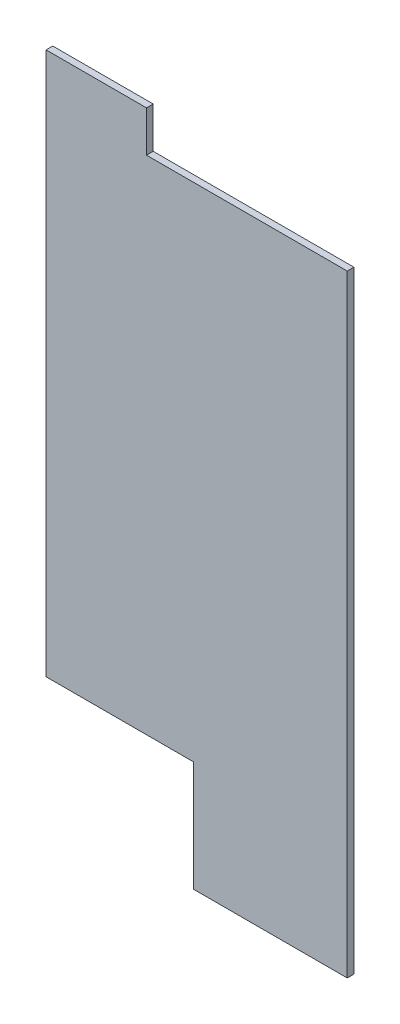
ISO-10303-21;
HEADER;
FILE_DESCRIPTION(('STEP AP214'),'2;1');
FILE_NAME('part.step','',(''),(''),'','','');
FILE_SCHEMA(('AUTOMOTIVE_DESIGN { 1 0 10303 214 1 1 1 1 }'));
ENDSEC;
DATA;
#1=APPLICATION_CONTEXT('core data for automotive mechanical design processes');
#2=APPLICATION_PROTOCOL_DEFINITION('international standard','automotive_design',2000,#1);
#3=PRODUCT_CONTEXT('',#1,'mechanical');
#4=PRODUCT('Part','Part','',(#3));
#5=PRODUCT_RELATED_PRODUCT_CATEGORY('part','',(#4));
#6=PRODUCT_DEFINITION_FORMATION('','',#4);
#7=PRODUCT_DEFINITION_CONTEXT('part definition',#1,'design');
#8=PRODUCT_DEFINITION('design','',#6,#7);
#9=PRODUCT_DEFINITION_SHAPE('','',#8);
#10=(LENGTH_UNIT() NAMED_UNIT(*) SI_UNIT(.MILLI.,.METRE.));
#11=(NAMED_UNIT(*) PLANE_ANGLE_UNIT() SI_UNIT($,.RADIAN.));
#12=(NAMED_UNIT(*) SI_UNIT($,.STERADIAN.) SOLID_ANGLE_UNIT());
#13=UNCERTAINTY_MEASURE_WITH_UNIT(LENGTH_MEASURE(1.E-05),#10,'distance_accuracy_value','');
#14=(GEOMETRIC_REPRESENTATION_CONTEXT(3) GLOBAL_UNCERTAINTY_ASSIGNED_CONTEXT((#13)) GLOBAL_UNIT_ASSIGNED_CONTEXT((#10,
#11,#12)) REPRESENTATION_CONTEXT('',''));
#15=CARTESIAN_POINT('',(0.,0.,0.));
#16=DIRECTION('',(0.,0.,1.));
#17=DIRECTION('',(1.,0.,0.));
#18=AXIS2_PLACEMENT_3D('',#15,#16,#17);
#19=CARTESIAN_POINT('',(-22.5,-37.5,1.));
#20=DIRECTION('',(1.,0.,0.));
#21=DIRECTION('',(0.,0.,-1.));
#22=AXIS2_PLACEMENT_3D('',#19,#20,#21);
#23=PLANE('',#22);
#24=DIRECTION('',(0.,-1.,0.));
#25=VECTOR('',#24,1.);
#26=CARTESIAN_POINT('',(-22.5,-37.5,0.));
#27=LINE('',#26,#25);
#28=CARTESIAN_POINT('',(-22.5,43.6220085638954,0.));
#29=VERTEX_POINT('',#28);
#30=CARTESIAN_POINT('',(-22.5,-37.5,0.));
#31=VERTEX_POINT('',#30);
#32=EDGE_CURVE('E133',#29,#31,#27,.T.);
#33=ORIENTED_EDGE('',*,*,#32,.T.);
#34=DIRECTION('',(0.,0.,-1.));
#35=VECTOR('',#34,1.);
#36=CARTESIAN_POINT('',(-22.5,-37.5,1.));
#37=LINE('',#36,#35);
#38=CARTESIAN_POINT('',(-22.5,-37.5,1.));
#39=VERTEX_POINT('',#38);
#40=EDGE_CURVE('E11',#39,#31,#37,.T.);
#41=ORIENTED_EDGE('',*,*,#40,.F.);
#42=DIRECTION('',(0.,-1.,0.));
#43=VECTOR('',#42,1.);
#44=CARTESIAN_POINT('',(-22.5,-37.5,1.));
#45=LINE('',#44,#43);
#46=CARTESIAN_POINT('',(-22.5,43.6220085638954,1.));
#47=VERTEX_POINT('',#46);
#48=EDGE_CURVE('E117',#47,#39,#45,.T.);
#49=ORIENTED_EDGE('',*,*,#48,.F.);
#50=DIRECTION('',(0.,0.,1.));
#51=VECTOR('',#50,1.);
#52=CARTESIAN_POINT('',(-22.5,43.6220085638954,0.));
#53=LINE('',#52,#51);
#54=EDGE_CURVE('E156',#29,#47,#53,.T.);
#55=ORIENTED_EDGE('',*,*,#54,.F.);
#56=EDGE_LOOP('',(#33,#41,#49,#55));
#57=FACE_BOUND('',#56,.T.);
#58=ADVANCED_FACE('F33',(#57),#23,.F.);
#59=CARTESIAN_POINT('',(22.5,-37.5,1.));
#60=DIRECTION('',(0.,1.,0.));
#61=DIRECTION('',(-1.,0.,0.));
#62=AXIS2_PLACEMENT_3D('',#59,#60,#61);
#63=PLANE('',#62);
#64=DIRECTION('',(1.,0.,0.));
#65=VECTOR('',#64,1.);
#66=CARTESIAN_POINT('',(22.5,-37.5,0.));
#67=LINE('',#66,#65);
#68=CARTESIAN_POINT('',(-0.500000000000002,-37.5,0.));
#69=VERTEX_POINT('',#68);
#70=EDGE_CURVE('E123',#31,#69,#67,.T.);
#71=ORIENTED_EDGE('',*,*,#70,.T.);
#72=DIRECTION('',(0.,0.,1.));
#73=VECTOR('',#72,1.);
#74=CARTESIAN_POINT('',(-0.500000000000002,-37.5,0.));
#75=LINE('',#74,#73);
#76=CARTESIAN_POINT('',(-0.499999999999997,-37.5,1.));
#77=VERTEX_POINT('',#76);
#78=EDGE_CURVE('E135',#69,#77,#75,.T.);
#79=ORIENTED_EDGE('',*,*,#78,.T.);
#80=DIRECTION('',(1.,0.,0.));
#81=VECTOR('',#80,1.);
#82=CARTESIAN_POINT('',(22.5,-37.5,1.));
#83=LINE('',#82,#81);
#84=EDGE_CURVE('E121',#39,#77,#83,.T.);
#85=ORIENTED_EDGE('',*,*,#84,.F.);
#86=ORIENTED_EDGE('',*,*,#40,.T.);
#87=EDGE_LOOP('',(#71,#79,#85,#86));
#88=FACE_BOUND('',#87,.T.);
#89=ADVANCED_FACE('F138',(#88),#63,.F.);
#90=CARTESIAN_POINT('',(22.5,-37.5,1.));
#91=DIRECTION('',(-1.,0.,0.));
#92=DIRECTION('',(0.,0.,1.));
#93=AXIS2_PLACEMENT_3D('',#90,#91,#92);
#94=PLANE('',#93);
#95=DIRECTION('',(0.,1.,0.));
#96=VECTOR('',#95,1.);
#97=CARTESIAN_POINT('',(22.5,-37.5,0.));
#98=LINE('',#97,#96);
#99=CARTESIAN_POINT('',(22.5,-53.9792860244863,0.));
#100=VERTEX_POINT('',#99);
#101=CARTESIAN_POINT('',(22.5,37.5,0.));
#102=VERTEX_POINT('',#101);
#103=EDGE_CURVE('E118',#100,#102,#98,.T.);
#104=ORIENTED_EDGE('',*,*,#103,.T.);
#105=DIRECTION('',(0.,0.,-1.));
#106=VECTOR('',#105,1.);
#107=CARTESIAN_POINT('',(22.5,37.5,1.));
#108=LINE('',#107,#106);
#109=CARTESIAN_POINT('',(22.5,37.5,1.));
#110=VERTEX_POINT('',#109);
#111=EDGE_CURVE('E40',#110,#102,#108,.T.);
#112=ORIENTED_EDGE('',*,*,#111,.F.);
#113=DIRECTION('',(0.,1.,0.));
#114=VECTOR('',#113,1.);
#115=CARTESIAN_POINT('',(22.5,-37.5,1.));
#116=LINE('',#115,#114);
#117=CARTESIAN_POINT('',(22.5,-53.9792860244863,1.));
#118=VERTEX_POINT('',#117);
#119=EDGE_CURVE('E127',#118,#110,#116,.T.);
#120=ORIENTED_EDGE('',*,*,#119,.F.);
#121=DIRECTION('',(0.,0.,1.));
#122=VECTOR('',#121,1.);
#123=CARTESIAN_POINT('',(22.5,-53.9792860244863,0.));
#124=LINE('',#123,#122);
#125=EDGE_CURVE('E159',#100,#118,#124,.T.);
#126=ORIENTED_EDGE('',*,*,#125,.F.);
#127=EDGE_LOOP('',(#104,#112,#120,#126));
#128=FACE_BOUND('',#127,.T.);
#129=ADVANCED_FACE('F190',(#128),#94,.F.);
#130=CARTESIAN_POINT('',(22.5,37.5,1.));
#131=DIRECTION('',(0.,-1.,0.));
#132=DIRECTION('',(1.,0.,0.));
#133=AXIS2_PLACEMENT_3D('',#130,#131,#132);
#134=PLANE('',#133);
#135=DIRECTION('',(-1.,0.,0.));
#136=VECTOR('',#135,1.);
#137=CARTESIAN_POINT('',(22.5,37.5,0.));
#138=LINE('',#137,#136);
#139=CARTESIAN_POINT('',(-7.4939592120975,37.5,0.));
#140=VERTEX_POINT('',#139);
#141=EDGE_CURVE('E110',#102,#140,#138,.T.);
#142=ORIENTED_EDGE('',*,*,#141,.T.);
#143=DIRECTION('',(0.,0.,1.));
#144=VECTOR('',#143,1.);
#145=CARTESIAN_POINT('',(-7.4939592120975,37.5,0.));
#146=LINE('',#145,#144);
#147=CARTESIAN_POINT('',(-7.49395921209749,37.5,1.));
#148=VERTEX_POINT('',#147);
#149=EDGE_CURVE('E95',#140,#148,#146,.T.);
#150=ORIENTED_EDGE('',*,*,#149,.T.);
#151=DIRECTION('',(-1.,0.,0.));
#152=VECTOR('',#151,1.);
#153=CARTESIAN_POINT('',(22.5,37.5,1.));
#154=LINE('',#153,#152);
#155=EDGE_CURVE('E126',#110,#148,#154,.T.);
#156=ORIENTED_EDGE('',*,*,#155,.F.);
#157=ORIENTED_EDGE('',*,*,#111,.T.);
#158=EDGE_LOOP('',(#142,#150,#156,#157));
#159=FACE_BOUND('',#158,.T.);
#160=ADVANCED_FACE('F115',(#159),#134,.F.);
#161=CARTESIAN_POINT('',(0.,0.,1.));
#162=DIRECTION('',(0.,0.,1.));
#163=DIRECTION('',(1.,0.,0.));
#164=AXIS2_PLACEMENT_3D('',#161,#162,#163);
#165=PLANE('',#164);
#166=ORIENTED_EDGE('',*,*,#48,.T.);
#167=ORIENTED_EDGE('',*,*,#84,.T.);
#168=DIRECTION('',(0.,-1.,0.));
#169=VECTOR('',#168,1.);
#170=CARTESIAN_POINT('',(-0.500000000000002,-37.5,1.));
#171=LINE('',#170,#169);
#172=CARTESIAN_POINT('',(-0.500000000000004,-53.9792860244863,1.));
#173=VERTEX_POINT('',#172);
#174=EDGE_CURVE('E55',#77,#173,#171,.T.);
#175=ORIENTED_EDGE('',*,*,#174,.T.);
#176=DIRECTION('',(1.,0.,0.));
#177=VECTOR('',#176,1.);
#178=CARTESIAN_POINT('',(-0.500000000000004,-53.9792860244863,1.));
#179=LINE('',#178,#177);
#180=EDGE_CURVE('E148',#173,#118,#179,.T.);
#181=ORIENTED_EDGE('',*,*,#180,.T.);
#182=ORIENTED_EDGE('',*,*,#119,.T.);
#183=ORIENTED_EDGE('',*,*,#155,.T.);
#184=DIRECTION('',(0.,1.,0.));
#185=VECTOR('',#184,1.);
#186=CARTESIAN_POINT('',(-7.4939592120975,43.6220085638954,1.));
#187=LINE('',#186,#185);
#188=CARTESIAN_POINT('',(-7.4939592120975,43.6220085638954,1.));
#189=VERTEX_POINT('',#188);
#190=EDGE_CURVE('E47',#148,#189,#187,.T.);
#191=ORIENTED_EDGE('',*,*,#190,.T.);
#192=DIRECTION('',(-1.,0.,0.));
#193=VECTOR('',#192,1.);
#194=CARTESIAN_POINT('',(-22.5,43.6220085638954,1.));
#195=LINE('',#194,#193);
#196=EDGE_CURVE('E112',#189,#47,#195,.T.);
#197=ORIENTED_EDGE('',*,*,#196,.T.);
#198=EDGE_LOOP('',(#166,#167,#175,#181,#182,#183,#191,#197));
#199=FACE_BOUND('',#198,.T.);
#200=ADVANCED_FACE('F162',(#199),#165,.T.);
#201=CARTESIAN_POINT('',(0.,0.,0.));
#202=DIRECTION('',(0.,0.,1.));
#203=DIRECTION('',(1.,0.,0.));
#204=AXIS2_PLACEMENT_3D('',#201,#202,#203);
#205=PLANE('',#204);
#206=ORIENTED_EDGE('',*,*,#32,.F.);
#207=DIRECTION('',(-1.,0.,0.));
#208=VECTOR('',#207,1.);
#209=CARTESIAN_POINT('',(-22.5,43.6220085638954,0.));
#210=LINE('',#209,#208);
#211=CARTESIAN_POINT('',(-7.4939592120975,43.6220085638954,0.));
#212=VERTEX_POINT('',#211);
#213=EDGE_CURVE('E105',#212,#29,#210,.T.);
#214=ORIENTED_EDGE('',*,*,#213,.F.);
#215=DIRECTION('',(0.,1.,0.));
#216=VECTOR('',#215,1.);
#217=CARTESIAN_POINT('',(-7.4939592120975,43.6220085638954,0.));
#218=LINE('',#217,#216);
#219=EDGE_CURVE('E98',#140,#212,#218,.T.);
#220=ORIENTED_EDGE('',*,*,#219,.F.);
#221=ORIENTED_EDGE('',*,*,#141,.F.);
#222=ORIENTED_EDGE('',*,*,#103,.F.);
#223=DIRECTION('',(1.,0.,0.));
#224=VECTOR('',#223,1.);
#225=CARTESIAN_POINT('',(-0.500000000000004,-53.9792860244863,0.));
#226=LINE('',#225,#224);
#227=CARTESIAN_POINT('',(-0.500000000000004,-53.9792860244863,0.));
#228=VERTEX_POINT('',#227);
#229=EDGE_CURVE('E147',#228,#100,#226,.T.);
#230=ORIENTED_EDGE('',*,*,#229,.F.);
#231=DIRECTION('',(0.,-1.,0.));
#232=VECTOR('',#231,1.);
#233=CARTESIAN_POINT('',(-0.500000000000002,-37.5,0.));
#234=LINE('',#233,#232);
#235=EDGE_CURVE('E145',#69,#228,#234,.T.);
#236=ORIENTED_EDGE('',*,*,#235,.F.);
#237=ORIENTED_EDGE('',*,*,#70,.F.);
#238=EDGE_LOOP('',(#206,#214,#220,#221,#222,#230,#236,#237));
#239=FACE_BOUND('',#238,.T.);
#240=ADVANCED_FACE('F109',(#239),#205,.F.);
#241=CARTESIAN_POINT('',(-0.500000000000002,-37.5,0.));
#242=DIRECTION('',(-1.,0.,0.));
#243=DIRECTION('',(0.,-1.,0.));
#244=AXIS2_PLACEMENT_3D('',#241,#242,#243);
#245=PLANE('',#244);
#246=ORIENTED_EDGE('',*,*,#174,.F.);
#247=ORIENTED_EDGE('',*,*,#78,.F.);
#248=ORIENTED_EDGE('',*,*,#235,.T.);
#249=DIRECTION('',(0.,0.,1.));
#250=VECTOR('',#249,1.);
#251=CARTESIAN_POINT('',(-0.500000000000004,-53.9792860244863,0.));
#252=LINE('',#251,#250);
#253=EDGE_CURVE('E150',#228,#173,#252,.T.);
#254=ORIENTED_EDGE('',*,*,#253,.T.);
#255=EDGE_LOOP('',(#246,#247,#248,#254));
#256=FACE_BOUND('',#255,.T.);
#257=ADVANCED_FACE('F182',(#256),#245,.T.);
#258=CARTESIAN_POINT('',(-0.500000000000004,-53.9792860244863,0.));
#259=DIRECTION('',(0.,-1.,0.));
#260=DIRECTION('',(0.,0.,-1.));
#261=AXIS2_PLACEMENT_3D('',#258,#259,#260);
#262=PLANE('',#261);
#263=ORIENTED_EDGE('',*,*,#180,.F.);
#264=ORIENTED_EDGE('',*,*,#253,.F.);
#265=ORIENTED_EDGE('',*,*,#229,.T.);
#266=ORIENTED_EDGE('',*,*,#125,.T.);
#267=EDGE_LOOP('',(#263,#264,#265,#266));
#268=FACE_BOUND('',#267,.T.);
#269=ADVANCED_FACE('F174',(#268),#262,.T.);
#270=CARTESIAN_POINT('',(-22.5,43.6220085638954,0.));
#271=DIRECTION('',(0.,1.,0.));
#272=DIRECTION('',(0.,0.,1.));
#273=AXIS2_PLACEMENT_3D('',#270,#271,#272);
#274=PLANE('',#273);
#275=ORIENTED_EDGE('',*,*,#196,.F.);
#276=DIRECTION('',(0.,0.,1.));
#277=VECTOR('',#276,1.);
#278=CARTESIAN_POINT('',(-7.4939592120975,43.6220085638954,0.));
#279=LINE('',#278,#277);
#280=EDGE_CURVE('E104',#212,#189,#279,.T.);
#281=ORIENTED_EDGE('',*,*,#280,.F.);
#282=ORIENTED_EDGE('',*,*,#213,.T.);
#283=ORIENTED_EDGE('',*,*,#54,.T.);
#284=EDGE_LOOP('',(#275,#281,#282,#283));
#285=FACE_BOUND('',#284,.T.);
#286=ADVANCED_FACE('F169',(#285),#274,.T.);
#287=CARTESIAN_POINT('',(-7.4939592120975,43.6220085638954,0.));
#288=DIRECTION('',(1.,0.,0.));
#289=DIRECTION('',(0.,1.,0.));
#290=AXIS2_PLACEMENT_3D('',#287,#288,#289);
#291=PLANE('',#290);
#292=ORIENTED_EDGE('',*,*,#190,.F.);
#293=ORIENTED_EDGE('',*,*,#149,.F.);
#294=ORIENTED_EDGE('',*,*,#219,.T.);
#295=ORIENTED_EDGE('',*,*,#280,.T.);
#296=EDGE_LOOP('',(#292,#293,#294,#295));
#297=FACE_BOUND('',#296,.T.);
#298=ADVANCED_FACE('F97',(#297),#291,.T.);
#299=CLOSED_SHELL('',(#58,#89,#129,#160,#200,#240,#257,#269,#286,#298));
#300=MANIFOLD_SOLID_BREP('B2',#299);
#301=ADVANCED_BREP_SHAPE_REPRESENTATION('',(#18,#300),#14);
#302=SHAPE_DEFINITION_REPRESENTATION(#9,#301);
ENDSEC;
END-ISO-10303-21;
